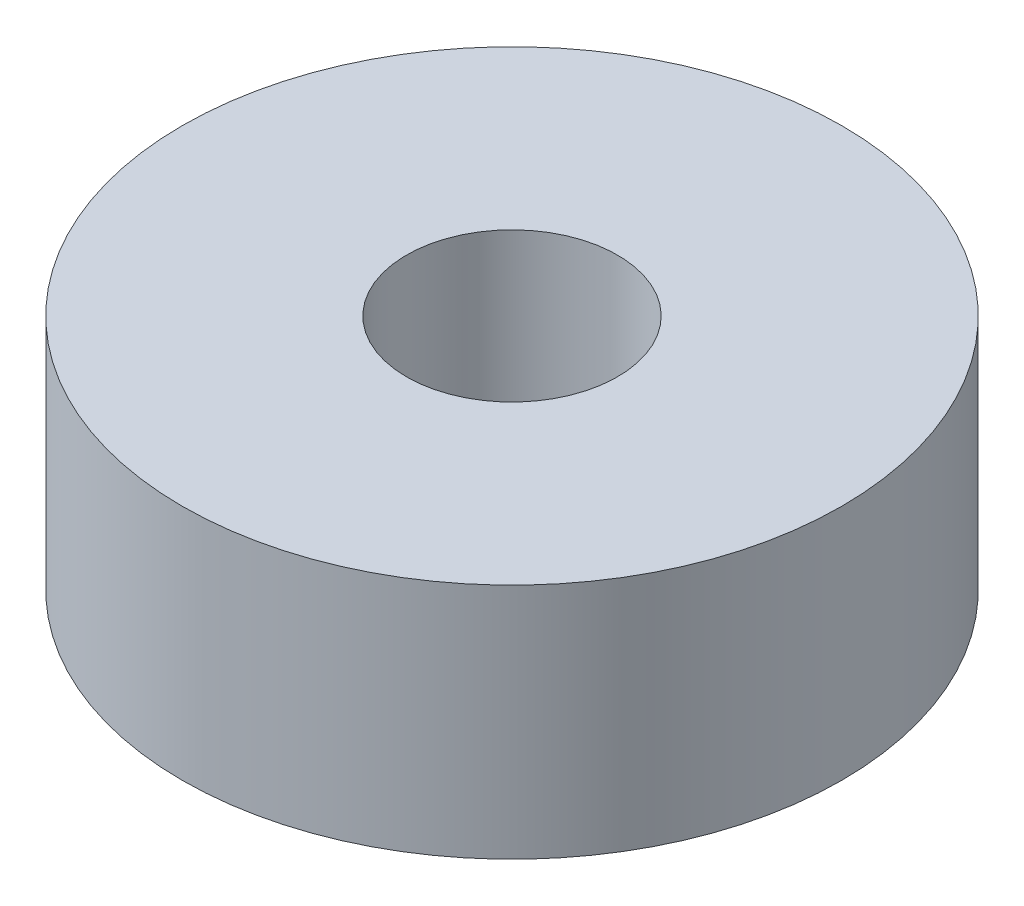
ISO-10303-21;
HEADER;
FILE_DESCRIPTION(('STEP AP214'),'2;1');
FILE_NAME('part.step','',(''),(''),'','','');
FILE_SCHEMA(('AUTOMOTIVE_DESIGN { 1 0 10303 214 1 1 1 1 }'));
ENDSEC;
DATA;
#1=APPLICATION_CONTEXT('core data for automotive mechanical design processes');
#2=APPLICATION_PROTOCOL_DEFINITION('international standard','automotive_design',2000,#1);
#3=PRODUCT_CONTEXT('',#1,'mechanical');
#4=PRODUCT('Part','Part','',(#3));
#5=PRODUCT_RELATED_PRODUCT_CATEGORY('part','',(#4));
#6=PRODUCT_DEFINITION_FORMATION('','',#4);
#7=PRODUCT_DEFINITION_CONTEXT('part definition',#1,'design');
#8=PRODUCT_DEFINITION('design','',#6,#7);
#9=PRODUCT_DEFINITION_SHAPE('','',#8);
#10=(LENGTH_UNIT() NAMED_UNIT(*) SI_UNIT(.MILLI.,.METRE.));
#11=(NAMED_UNIT(*) PLANE_ANGLE_UNIT() SI_UNIT($,.RADIAN.));
#12=(NAMED_UNIT(*) SI_UNIT($,.STERADIAN.) SOLID_ANGLE_UNIT());
#13=UNCERTAINTY_MEASURE_WITH_UNIT(LENGTH_MEASURE(1.E-05),#10,'distance_accuracy_value','');
#14=(GEOMETRIC_REPRESENTATION_CONTEXT(3) GLOBAL_UNCERTAINTY_ASSIGNED_CONTEXT((#13)) GLOBAL_UNIT_ASSIGNED_CONTEXT((#10,
#11,#12)) REPRESENTATION_CONTEXT('',''));
#15=CARTESIAN_POINT('',(0.,0.,0.));
#16=DIRECTION('',(0.,0.,1.));
#17=DIRECTION('',(1.,0.,0.));
#18=AXIS2_PLACEMENT_3D('',#15,#16,#17);
#19=CARTESIAN_POINT('',(0.,18.,0.));
#20=DIRECTION('',(0.,1.,0.));
#21=DIRECTION('',(0.,0.,1.));
#22=AXIS2_PLACEMENT_3D('',#19,#20,#21);
#23=PLANE('',#22);
#24=CARTESIAN_POINT('',(0.,18.,0.));
#25=DIRECTION('',(0.,1.,0.));
#26=DIRECTION('',(0.,0.,1.));
#27=AXIS2_PLACEMENT_3D('',#24,#25,#26);
#28=CIRCLE('',#27,25.);
#29=CARTESIAN_POINT('',(0.,18.,25.));
#30=VERTEX_POINT('',#29);
#31=EDGE_CURVE('E10',#30,#30,#28,.T.);
#32=ORIENTED_EDGE('',*,*,#31,.T.);
#33=EDGE_LOOP('',(#32));
#34=FACE_BOUND('',#33,.T.);
#35=CARTESIAN_POINT('',(0.,18.,0.));
#36=DIRECTION('',(0.,1.,0.));
#37=DIRECTION('',(0.,0.,1.));
#38=AXIS2_PLACEMENT_3D('',#35,#36,#37);
#39=CIRCLE('',#38,8.);
#40=CARTESIAN_POINT('',(0.,18.,8.));
#41=VERTEX_POINT('',#40);
#42=EDGE_CURVE('E44',#41,#41,#39,.T.);
#43=ORIENTED_EDGE('',*,*,#42,.F.);
#44=EDGE_LOOP('',(#43));
#45=FACE_BOUND('',#44,.T.);
#46=ADVANCED_FACE('F33',(#34,#45),#23,.T.);
#47=CARTESIAN_POINT('',(0.,0.,0.));
#48=DIRECTION('',(0.,1.,0.));
#49=DIRECTION('',(0.,0.,1.));
#50=AXIS2_PLACEMENT_3D('',#47,#48,#49);
#51=PLANE('',#50);
#52=CARTESIAN_POINT('',(0.,0.,0.));
#53=DIRECTION('',(0.,1.,0.));
#54=DIRECTION('',(0.,0.,1.));
#55=AXIS2_PLACEMENT_3D('',#52,#53,#54);
#56=CIRCLE('',#55,25.);
#57=CARTESIAN_POINT('',(0.,0.,25.));
#58=VERTEX_POINT('',#57);
#59=EDGE_CURVE('E37',#58,#58,#56,.T.);
#60=ORIENTED_EDGE('',*,*,#59,.F.);
#61=EDGE_LOOP('',(#60));
#62=FACE_BOUND('',#61,.T.);
#63=CARTESIAN_POINT('',(0.,0.,0.));
#64=DIRECTION('',(0.,1.,0.));
#65=DIRECTION('',(0.,0.,1.));
#66=AXIS2_PLACEMENT_3D('',#63,#64,#65);
#67=CIRCLE('',#66,8.);
#68=CARTESIAN_POINT('',(0.,0.,8.));
#69=VERTEX_POINT('',#68);
#70=EDGE_CURVE('E46',#69,#69,#67,.T.);
#71=ORIENTED_EDGE('',*,*,#70,.T.);
#72=EDGE_LOOP('',(#71));
#73=FACE_BOUND('',#72,.T.);
#74=ADVANCED_FACE('F56',(#62,#73),#51,.F.);
#75=CARTESIAN_POINT('',(0.,18.,0.));
#76=DIRECTION('',(0.,-1.,0.));
#77=DIRECTION('',(0.,0.,-1.));
#78=AXIS2_PLACEMENT_3D('',#75,#76,#77);
#79=CYLINDRICAL_SURFACE('',#78,25.);
#80=ORIENTED_EDGE('',*,*,#31,.F.);
#81=EDGE_LOOP('',(#80));
#82=FACE_BOUND('',#81,.T.);
#83=ORIENTED_EDGE('',*,*,#59,.T.);
#84=EDGE_LOOP('',(#83));
#85=FACE_BOUND('',#84,.T.);
#86=ADVANCED_FACE('F35',(#82,#85),#79,.T.);
#87=CARTESIAN_POINT('',(0.,18.,0.));
#88=DIRECTION('',(0.,-1.,0.));
#89=DIRECTION('',(0.,0.,-1.));
#90=AXIS2_PLACEMENT_3D('',#87,#88,#89);
#91=CYLINDRICAL_SURFACE('',#90,8.);
#92=ORIENTED_EDGE('',*,*,#42,.T.);
#93=EDGE_LOOP('',(#92));
#94=FACE_BOUND('',#93,.T.);
#95=ORIENTED_EDGE('',*,*,#70,.F.);
#96=EDGE_LOOP('',(#95));
#97=FACE_BOUND('',#96,.T.);
#98=ADVANCED_FACE('F52',(#94,#97),#91,.F.);
#99=CLOSED_SHELL('',(#46,#74,#86,#98));
#100=MANIFOLD_SOLID_BREP('B2',#99);
#101=ADVANCED_BREP_SHAPE_REPRESENTATION('',(#18,#100),#14);
#102=SHAPE_DEFINITION_REPRESENTATION(#9,#101);
ENDSEC;
END-ISO-10303-21;
